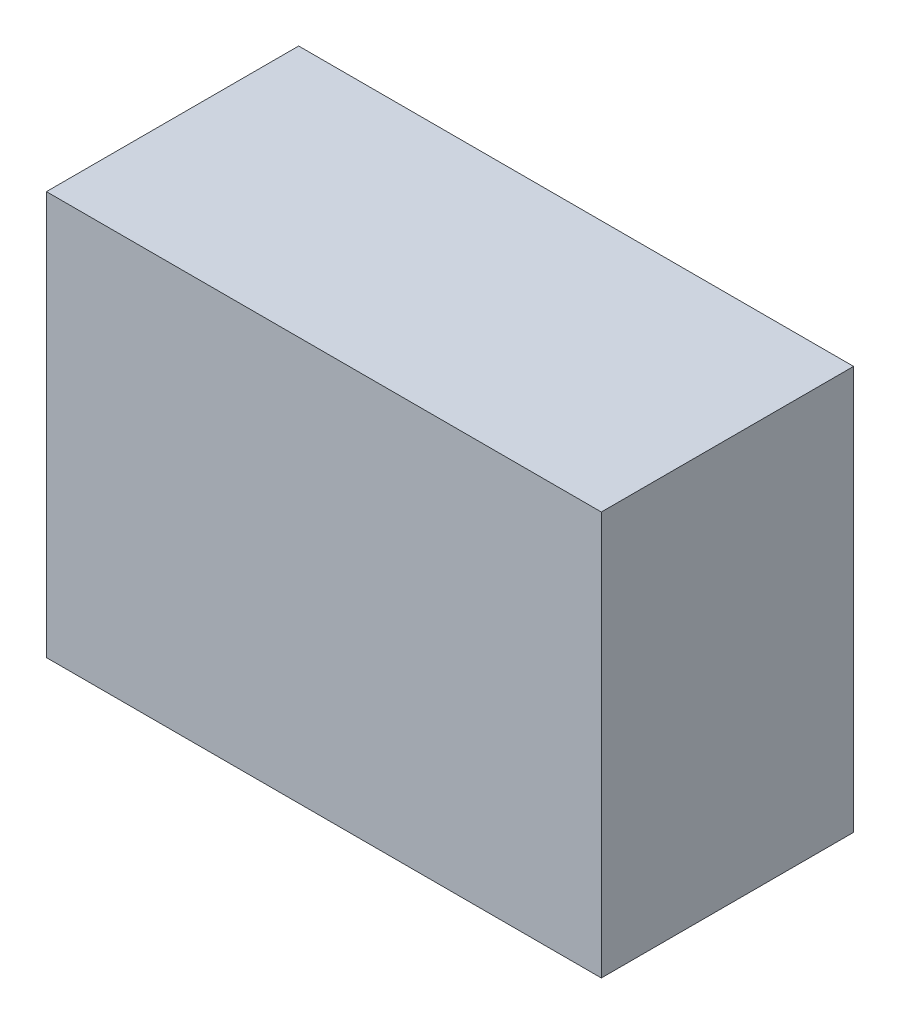
ISO-10303-21;
HEADER;
FILE_DESCRIPTION(('STEP AP214'),'2;1');
FILE_NAME('part.step','',(''),(''),'','','');
FILE_SCHEMA(('AUTOMOTIVE_DESIGN { 1 0 10303 214 1 1 1 1 }'));
ENDSEC;
DATA;
#1=APPLICATION_CONTEXT('core data for automotive mechanical design processes');
#2=APPLICATION_PROTOCOL_DEFINITION('international standard','automotive_design',2000,#1);
#3=PRODUCT_CONTEXT('',#1,'mechanical');
#4=PRODUCT('Part','Part','',(#3));
#5=PRODUCT_RELATED_PRODUCT_CATEGORY('part','',(#4));
#6=PRODUCT_DEFINITION_FORMATION('','',#4);
#7=PRODUCT_DEFINITION_CONTEXT('part definition',#1,'design');
#8=PRODUCT_DEFINITION('design','',#6,#7);
#9=PRODUCT_DEFINITION_SHAPE('','',#8);
#10=(LENGTH_UNIT() NAMED_UNIT(*) SI_UNIT(.MILLI.,.METRE.));
#11=(NAMED_UNIT(*) PLANE_ANGLE_UNIT() SI_UNIT($,.RADIAN.));
#12=(NAMED_UNIT(*) SI_UNIT($,.STERADIAN.) SOLID_ANGLE_UNIT());
#13=UNCERTAINTY_MEASURE_WITH_UNIT(LENGTH_MEASURE(1.E-05),#10,'distance_accuracy_value','');
#14=(GEOMETRIC_REPRESENTATION_CONTEXT(3) GLOBAL_UNCERTAINTY_ASSIGNED_CONTEXT((#13)) GLOBAL_UNIT_ASSIGNED_CONTEXT((#10,
#11,#12)) REPRESENTATION_CONTEXT('',''));
#15=CARTESIAN_POINT('',(0.,0.,0.));
#16=DIRECTION('',(0.,0.,1.));
#17=DIRECTION('',(1.,0.,0.));
#18=AXIS2_PLACEMENT_3D('',#15,#16,#17);
#19=CARTESIAN_POINT('',(0.,0.,20.));
#20=DIRECTION('',(1.,0.,0.));
#21=DIRECTION('',(0.,1.,0.));
#22=AXIS2_PLACEMENT_3D('',#19,#20,#21);
#23=PLANE('',#22);
#24=DIRECTION('',(0.,-1.,0.));
#25=VECTOR('',#24,1.);
#26=CARTESIAN_POINT('',(0.,0.,0.));
#27=LINE('',#26,#25);
#28=CARTESIAN_POINT('',(0.,32.,0.));
#29=VERTEX_POINT('',#28);
#30=CARTESIAN_POINT('',(0.,0.,0.));
#31=VERTEX_POINT('',#30);
#32=EDGE_CURVE('E96',#29,#31,#27,.T.);
#33=ORIENTED_EDGE('',*,*,#32,.T.);
#34=DIRECTION('',(0.,0.,-1.));
#35=VECTOR('',#34,1.);
#36=CARTESIAN_POINT('',(0.,0.,20.));
#37=LINE('',#36,#35);
#38=CARTESIAN_POINT('',(0.,0.,20.));
#39=VERTEX_POINT('',#38);
#40=EDGE_CURVE('E11',#39,#31,#37,.T.);
#41=ORIENTED_EDGE('',*,*,#40,.F.);
#42=DIRECTION('',(0.,-1.,0.));
#43=VECTOR('',#42,1.);
#44=CARTESIAN_POINT('',(0.,0.,20.));
#45=LINE('',#44,#43);
#46=CARTESIAN_POINT('',(0.,32.,20.));
#47=VERTEX_POINT('',#46);
#48=EDGE_CURVE('E84',#47,#39,#45,.T.);
#49=ORIENTED_EDGE('',*,*,#48,.F.);
#50=DIRECTION('',(0.,0.,-1.));
#51=VECTOR('',#50,1.);
#52=CARTESIAN_POINT('',(0.,32.,20.));
#53=LINE('',#52,#51);
#54=EDGE_CURVE('E92',#47,#29,#53,.T.);
#55=ORIENTED_EDGE('',*,*,#54,.T.);
#56=EDGE_LOOP('',(#33,#41,#49,#55));
#57=FACE_BOUND('',#56,.T.);
#58=ADVANCED_FACE('F33',(#57),#23,.F.);
#59=CARTESIAN_POINT('',(0.,0.,20.));
#60=DIRECTION('',(0.,1.,0.));
#61=DIRECTION('',(0.,0.,1.));
#62=AXIS2_PLACEMENT_3D('',#59,#60,#61);
#63=PLANE('',#62);
#64=DIRECTION('',(1.,0.,0.));
#65=VECTOR('',#64,1.);
#66=CARTESIAN_POINT('',(0.,0.,0.));
#67=LINE('',#66,#65);
#68=CARTESIAN_POINT('',(44.,0.,0.));
#69=VERTEX_POINT('',#68);
#70=EDGE_CURVE('E88',#31,#69,#67,.T.);
#71=ORIENTED_EDGE('',*,*,#70,.T.);
#72=DIRECTION('',(0.,0.,-1.));
#73=VECTOR('',#72,1.);
#74=CARTESIAN_POINT('',(44.,0.,20.));
#75=LINE('',#74,#73);
#76=CARTESIAN_POINT('',(44.,0.,20.));
#77=VERTEX_POINT('',#76);
#78=EDGE_CURVE('E41',#77,#69,#75,.T.);
#79=ORIENTED_EDGE('',*,*,#78,.F.);
#80=DIRECTION('',(1.,0.,0.));
#81=VECTOR('',#80,1.);
#82=CARTESIAN_POINT('',(0.,0.,20.));
#83=LINE('',#82,#81);
#84=EDGE_CURVE('E79',#39,#77,#83,.T.);
#85=ORIENTED_EDGE('',*,*,#84,.F.);
#86=ORIENTED_EDGE('',*,*,#40,.T.);
#87=EDGE_LOOP('',(#71,#79,#85,#86));
#88=FACE_BOUND('',#87,.T.);
#89=ADVANCED_FACE('F87',(#88),#63,.F.);
#90=CARTESIAN_POINT('',(44.,0.,20.));
#91=DIRECTION('',(-1.,0.,0.));
#92=DIRECTION('',(0.,0.,1.));
#93=AXIS2_PLACEMENT_3D('',#90,#91,#92);
#94=PLANE('',#93);
#95=DIRECTION('',(0.,1.,0.));
#96=VECTOR('',#95,1.);
#97=CARTESIAN_POINT('',(44.,0.,0.));
#98=LINE('',#97,#96);
#99=CARTESIAN_POINT('',(44.,32.,0.));
#100=VERTEX_POINT('',#99);
#101=EDGE_CURVE('E66',#69,#100,#98,.T.);
#102=ORIENTED_EDGE('',*,*,#101,.T.);
#103=DIRECTION('',(0.,0.,-1.));
#104=VECTOR('',#103,1.);
#105=CARTESIAN_POINT('',(44.,32.,20.));
#106=LINE('',#105,#104);
#107=CARTESIAN_POINT('',(44.,32.,20.));
#108=VERTEX_POINT('',#107);
#109=EDGE_CURVE('E89',#108,#100,#106,.T.);
#110=ORIENTED_EDGE('',*,*,#109,.F.);
#111=DIRECTION('',(0.,1.,0.));
#112=VECTOR('',#111,1.);
#113=CARTESIAN_POINT('',(44.,0.,20.));
#114=LINE('',#113,#112);
#115=EDGE_CURVE('E82',#77,#108,#114,.T.);
#116=ORIENTED_EDGE('',*,*,#115,.F.);
#117=ORIENTED_EDGE('',*,*,#78,.T.);
#118=EDGE_LOOP('',(#102,#110,#116,#117));
#119=FACE_BOUND('',#118,.T.);
#120=ADVANCED_FACE('F90',(#119),#94,.F.);
#121=CARTESIAN_POINT('',(0.,32.,20.));
#122=DIRECTION('',(0.,-1.,0.));
#123=DIRECTION('',(0.,0.,-1.));
#124=AXIS2_PLACEMENT_3D('',#121,#122,#123);
#125=PLANE('',#124);
#126=DIRECTION('',(-1.,0.,0.));
#127=VECTOR('',#126,1.);
#128=CARTESIAN_POINT('',(0.,32.,0.));
#129=LINE('',#128,#127);
#130=EDGE_CURVE('E72',#100,#29,#129,.T.);
#131=ORIENTED_EDGE('',*,*,#130,.T.);
#132=ORIENTED_EDGE('',*,*,#54,.F.);
#133=DIRECTION('',(-1.,0.,0.));
#134=VECTOR('',#133,1.);
#135=CARTESIAN_POINT('',(0.,32.,20.));
#136=LINE('',#135,#134);
#137=EDGE_CURVE('E49',#108,#47,#136,.T.);
#138=ORIENTED_EDGE('',*,*,#137,.F.);
#139=ORIENTED_EDGE('',*,*,#109,.T.);
#140=EDGE_LOOP('',(#131,#132,#138,#139));
#141=FACE_BOUND('',#140,.T.);
#142=ADVANCED_FACE('F103',(#141),#125,.F.);
#143=CARTESIAN_POINT('',(0.,0.,20.));
#144=DIRECTION('',(0.,0.,-1.));
#145=DIRECTION('',(-1.,0.,0.));
#146=AXIS2_PLACEMENT_3D('',#143,#144,#145);
#147=PLANE('',#146);
#148=ORIENTED_EDGE('',*,*,#48,.T.);
#149=ORIENTED_EDGE('',*,*,#84,.T.);
#150=ORIENTED_EDGE('',*,*,#115,.T.);
#151=ORIENTED_EDGE('',*,*,#137,.T.);
#152=EDGE_LOOP('',(#148,#149,#150,#151));
#153=FACE_BOUND('',#152,.T.);
#154=ADVANCED_FACE('F80',(#153),#147,.F.);
#155=CARTESIAN_POINT('',(0.,0.,0.));
#156=DIRECTION('',(0.,0.,-1.));
#157=DIRECTION('',(-1.,0.,0.));
#158=AXIS2_PLACEMENT_3D('',#155,#156,#157);
#159=PLANE('',#158);
#160=ORIENTED_EDGE('',*,*,#32,.F.);
#161=ORIENTED_EDGE('',*,*,#130,.F.);
#162=ORIENTED_EDGE('',*,*,#101,.F.);
#163=ORIENTED_EDGE('',*,*,#70,.F.);
#164=EDGE_LOOP('',(#160,#161,#162,#163));
#165=FACE_BOUND('',#164,.T.);
#166=ADVANCED_FACE('F106',(#165),#159,.T.);
#167=CLOSED_SHELL('',(#58,#89,#120,#142,#154,#166));
#168=MANIFOLD_SOLID_BREP('B2',#167);
#169=ADVANCED_BREP_SHAPE_REPRESENTATION('',(#18,#168),#14);
#170=SHAPE_DEFINITION_REPRESENTATION(#9,#169);
ENDSEC;
END-ISO-10303-21;
